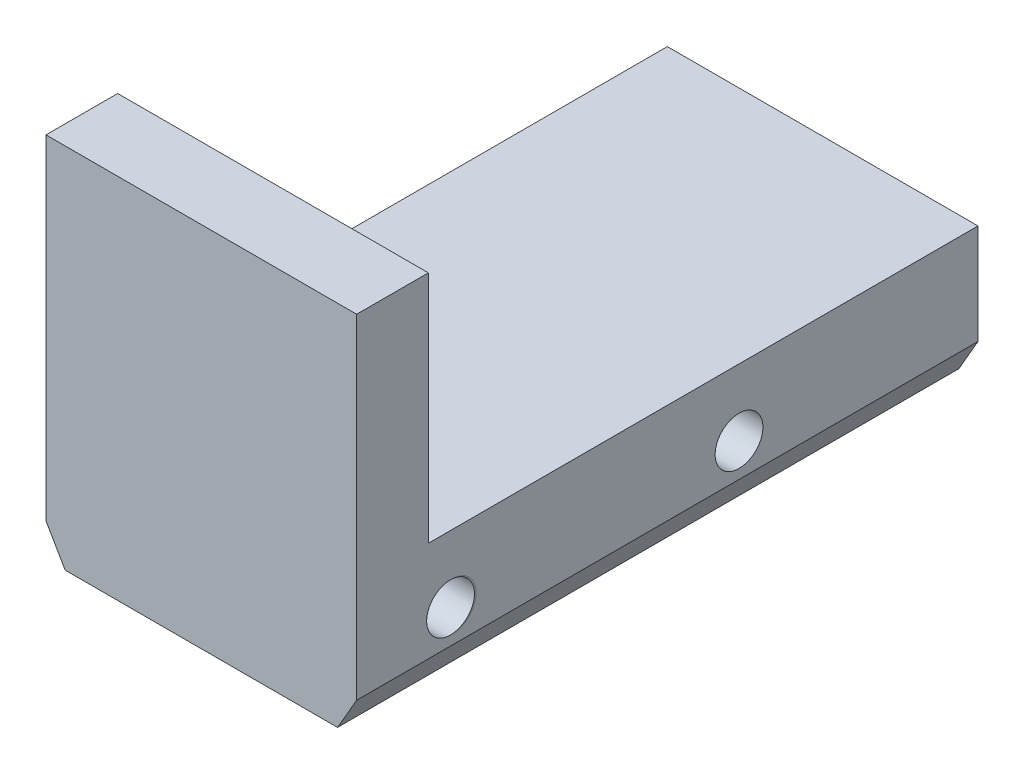
ISO-10303-21;
HEADER;
FILE_DESCRIPTION(('STEP AP214'),'2;1');
FILE_NAME('part.step','',(''),(''),'','','');
FILE_SCHEMA(('AUTOMOTIVE_DESIGN { 1 0 10303 214 1 1 1 1 }'));
ENDSEC;
DATA;
#1=APPLICATION_CONTEXT('core data for automotive mechanical design processes');
#2=APPLICATION_PROTOCOL_DEFINITION('international standard','automotive_design',2000,#1);
#3=PRODUCT_CONTEXT('',#1,'mechanical');
#4=PRODUCT('Part','Part','',(#3));
#5=PRODUCT_RELATED_PRODUCT_CATEGORY('part','',(#4));
#6=PRODUCT_DEFINITION_FORMATION('','',#4);
#7=PRODUCT_DEFINITION_CONTEXT('part definition',#1,'design');
#8=PRODUCT_DEFINITION('design','',#6,#7);
#9=PRODUCT_DEFINITION_SHAPE('','',#8);
#10=(LENGTH_UNIT() NAMED_UNIT(*) SI_UNIT(.MILLI.,.METRE.));
#11=(NAMED_UNIT(*) PLANE_ANGLE_UNIT() SI_UNIT($,.RADIAN.));
#12=(NAMED_UNIT(*) SI_UNIT($,.STERADIAN.) SOLID_ANGLE_UNIT());
#13=UNCERTAINTY_MEASURE_WITH_UNIT(LENGTH_MEASURE(1.E-05),#10,'distance_accuracy_value','');
#14=(GEOMETRIC_REPRESENTATION_CONTEXT(3) GLOBAL_UNCERTAINTY_ASSIGNED_CONTEXT((#13)) GLOBAL_UNIT_ASSIGNED_CONTEXT((#10,
#11,#12)) REPRESENTATION_CONTEXT('',''));
#15=CARTESIAN_POINT('',(0.,0.,0.));
#16=DIRECTION('',(0.,0.,1.));
#17=DIRECTION('',(1.,0.,0.));
#18=AXIS2_PLACEMENT_3D('',#15,#16,#17);
#19=CARTESIAN_POINT('',(0.,5.57372,-26.));
#20=DIRECTION('',(1.,0.,0.));
#21=DIRECTION('',(0.,0.,-1.));
#22=AXIS2_PLACEMENT_3D('',#19,#20,#21);
#23=PLANE('',#22);
#24=CARTESIAN_POINT('',(0.,2.78686,-3.92837));
#25=DIRECTION('',(-1.,0.,0.));
#26=DIRECTION('',(0.,0.,1.));
#27=AXIS2_PLACEMENT_3D('',#24,#25,#26);
#28=CIRCLE('',#27,1.);
#29=CARTESIAN_POINT('',(0.,2.78686,-2.92837));
#30=VERTEX_POINT('',#29);
#31=EDGE_CURVE('E116',#30,#30,#28,.T.);
#32=ORIENTED_EDGE('',*,*,#31,.F.);
#33=EDGE_LOOP('',(#32));
#34=FACE_BOUND('',#33,.T.);
#35=CARTESIAN_POINT('',(0.,2.78686,-16.));
#36=DIRECTION('',(-1.,0.,0.));
#37=DIRECTION('',(0.,0.,1.));
#38=AXIS2_PLACEMENT_3D('',#35,#36,#37);
#39=CIRCLE('',#38,1.);
#40=CARTESIAN_POINT('',(0.,2.78686,-15.));
#41=VERTEX_POINT('',#40);
#42=EDGE_CURVE('E128',#41,#41,#39,.T.);
#43=ORIENTED_EDGE('',*,*,#42,.F.);
#44=EDGE_LOOP('',(#43));
#45=FACE_BOUND('',#44,.T.);
#46=DIRECTION('',(0.,-1.,0.));
#47=VECTOR('',#46,1.);
#48=CARTESIAN_POINT('',(0.,5.57372,-26.));
#49=LINE('',#48,#47);
#50=CARTESIAN_POINT('',(0.,5.57372,-26.));
#51=VERTEX_POINT('',#50);
#52=CARTESIAN_POINT('',(0.,1.38564064605509,-26.));
#53=VERTEX_POINT('',#52);
#54=EDGE_CURVE('E215',#51,#53,#49,.T.);
#55=ORIENTED_EDGE('',*,*,#54,.T.);
#56=DIRECTION('',(0.,0.,1.));
#57=VECTOR('',#56,1.);
#58=CARTESIAN_POINT('',(0.,1.38564064605509,-26.));
#59=LINE('',#58,#57);
#60=CARTESIAN_POINT('',(0.,1.38564064605509,0.));
#61=VERTEX_POINT('',#60);
#62=EDGE_CURVE('E11',#53,#61,#59,.T.);
#63=ORIENTED_EDGE('',*,*,#62,.T.);
#64=DIRECTION('',(0.,-1.,0.));
#65=VECTOR('',#64,1.);
#66=CARTESIAN_POINT('',(0.,5.57372,0.));
#67=LINE('',#66,#65);
#68=CARTESIAN_POINT('',(0.,15.37372,0.));
#69=VERTEX_POINT('',#68);
#70=EDGE_CURVE('E173',#69,#61,#67,.T.);
#71=ORIENTED_EDGE('',*,*,#70,.F.);
#72=DIRECTION('',(0.,0.,1.));
#73=VECTOR('',#72,1.);
#74=CARTESIAN_POINT('',(0.,15.37372,0.));
#75=LINE('',#74,#73);
#76=CARTESIAN_POINT('',(0.,15.37372,-3.));
#77=VERTEX_POINT('',#76);
#78=EDGE_CURVE('E143',#77,#69,#75,.T.);
#79=ORIENTED_EDGE('',*,*,#78,.F.);
#80=DIRECTION('',(0.,-1.,0.));
#81=VECTOR('',#80,1.);
#82=CARTESIAN_POINT('',(0.,15.37372,-3.));
#83=LINE('',#82,#81);
#84=CARTESIAN_POINT('',(0.,5.57372,-3.));
#85=VERTEX_POINT('',#84);
#86=EDGE_CURVE('E146',#77,#85,#83,.T.);
#87=ORIENTED_EDGE('',*,*,#86,.T.);
#88=DIRECTION('',(0.,0.,1.));
#89=VECTOR('',#88,1.);
#90=CARTESIAN_POINT('',(0.,5.57372,-26.));
#91=LINE('',#90,#89);
#92=EDGE_CURVE('E210',#51,#85,#91,.T.);
#93=ORIENTED_EDGE('',*,*,#92,.F.);
#94=EDGE_LOOP('',(#55,#63,#71,#79,#87,#93));
#95=FACE_BOUND('',#94,.T.);
#96=ADVANCED_FACE('F33',(#34,#45,#95),#23,.F.);
#97=CARTESIAN_POINT('',(0.,5.57372,0.));
#98=DIRECTION('',(0.,0.,-1.));
#99=DIRECTION('',(-1.,0.,0.));
#100=AXIS2_PLACEMENT_3D('',#97,#98,#99);
#101=PLANE('',#100);
#102=DIRECTION('',(1.,0.,0.));
#103=VECTOR('',#102,1.);
#104=CARTESIAN_POINT('',(0.,0.,0.));
#105=LINE('',#104,#103);
#106=CARTESIAN_POINT('',(0.799999999999998,0.,0.));
#107=VERTEX_POINT('',#106);
#108=CARTESIAN_POINT('',(12.2,0.,0.));
#109=VERTEX_POINT('',#108);
#110=EDGE_CURVE('E164',#107,#109,#105,.T.);
#111=ORIENTED_EDGE('',*,*,#110,.T.);
#112=DIRECTION('',(-0.500000000000002,-0.866025403784438,0.));
#113=VECTOR('',#112,1.);
#114=CARTESIAN_POINT('',(13.,1.3856406460551,0.));
#115=LINE('',#114,#113);
#116=CARTESIAN_POINT('',(13.,1.3856406460551,0.));
#117=VERTEX_POINT('',#116);
#118=EDGE_CURVE('E41',#109,#117,#115,.F.);
#119=ORIENTED_EDGE('',*,*,#118,.T.);
#120=DIRECTION('',(0.,-1.,0.));
#121=VECTOR('',#120,1.);
#122=CARTESIAN_POINT('',(13.,5.57372,0.));
#123=LINE('',#122,#121);
#124=CARTESIAN_POINT('',(13.,15.37372,0.));
#125=VERTEX_POINT('',#124);
#126=EDGE_CURVE('E187',#125,#117,#123,.T.);
#127=ORIENTED_EDGE('',*,*,#126,.F.);
#128=DIRECTION('',(1.,0.,0.));
#129=VECTOR('',#128,1.);
#130=CARTESIAN_POINT('',(13.,15.37372,0.));
#131=LINE('',#130,#129);
#132=EDGE_CURVE('E135',#69,#125,#131,.T.);
#133=ORIENTED_EDGE('',*,*,#132,.F.);
#134=ORIENTED_EDGE('',*,*,#70,.T.);
#135=DIRECTION('',(-0.500000000000002,0.866025403784437,0.));
#136=VECTOR('',#135,1.);
#137=CARTESIAN_POINT('',(0.,1.38564064605509,0.));
#138=LINE('',#137,#136);
#139=EDGE_CURVE('E56',#61,#107,#138,.F.);
#140=ORIENTED_EDGE('',*,*,#139,.T.);
#141=EDGE_LOOP('',(#111,#119,#127,#133,#134,#140));
#142=FACE_BOUND('',#141,.T.);
#143=ADVANCED_FACE('F185',(#142),#101,.F.);
#144=CARTESIAN_POINT('',(13.,5.57372,0.));
#145=DIRECTION('',(-1.,0.,0.));
#146=DIRECTION('',(0.,0.,1.));
#147=AXIS2_PLACEMENT_3D('',#144,#145,#146);
#148=PLANE('',#147);
#149=CARTESIAN_POINT('',(13.,2.78686,-4.));
#150=DIRECTION('',(-1.,0.,0.));
#151=DIRECTION('',(0.,0.,1.));
#152=AXIS2_PLACEMENT_3D('',#149,#150,#151);
#153=CIRCLE('',#152,1.);
#154=CARTESIAN_POINT('',(13.,3.78621843708601,-3.964185));
#155=VERTEX_POINT('',#154);
#156=CARTESIAN_POINT('',(13.,1.78750156291399,-3.964185));
#157=VERTEX_POINT('',#156);
#158=EDGE_CURVE('E123',#155,#157,#153,.T.);
#159=ORIENTED_EDGE('',*,*,#158,.T.);
#160=CARTESIAN_POINT('',(13.,2.78686,-3.92837));
#161=DIRECTION('',(-1.,0.,0.));
#162=DIRECTION('',(0.,0.,1.));
#163=AXIS2_PLACEMENT_3D('',#160,#161,#162);
#164=CIRCLE('',#163,1.);
#165=EDGE_CURVE('E124',#157,#155,#164,.T.);
#166=ORIENTED_EDGE('',*,*,#165,.T.);
#167=EDGE_LOOP('',(#159,#166));
#168=FACE_BOUND('',#167,.T.);
#169=CARTESIAN_POINT('',(13.,2.78686,-16.));
#170=DIRECTION('',(-1.,0.,0.));
#171=DIRECTION('',(0.,0.,1.));
#172=AXIS2_PLACEMENT_3D('',#169,#170,#171);
#173=CIRCLE('',#172,1.);
#174=CARTESIAN_POINT('',(13.,2.78686,-15.));
#175=VERTEX_POINT('',#174);
#176=EDGE_CURVE('E134',#175,#175,#173,.T.);
#177=ORIENTED_EDGE('',*,*,#176,.T.);
#178=EDGE_LOOP('',(#177));
#179=FACE_BOUND('',#178,.T.);
#180=ORIENTED_EDGE('',*,*,#126,.T.);
#181=DIRECTION('',(0.,0.,-1.));
#182=VECTOR('',#181,1.);
#183=CARTESIAN_POINT('',(13.,1.3856406460551,0.));
#184=LINE('',#183,#182);
#185=CARTESIAN_POINT('',(13.,1.3856406460551,-26.));
#186=VERTEX_POINT('',#185);
#187=EDGE_CURVE('E169',#117,#186,#184,.T.);
#188=ORIENTED_EDGE('',*,*,#187,.T.);
#189=DIRECTION('',(0.,-1.,0.));
#190=VECTOR('',#189,1.);
#191=CARTESIAN_POINT('',(13.,5.57372,-26.));
#192=LINE('',#191,#190);
#193=CARTESIAN_POINT('',(13.,5.57372,-26.));
#194=VERTEX_POINT('',#193);
#195=EDGE_CURVE('E198',#194,#186,#192,.T.);
#196=ORIENTED_EDGE('',*,*,#195,.F.);
#197=DIRECTION('',(0.,0.,-1.));
#198=VECTOR('',#197,1.);
#199=CARTESIAN_POINT('',(13.,5.57372,0.));
#200=LINE('',#199,#198);
#201=CARTESIAN_POINT('',(13.,5.57372,-3.));
#202=VERTEX_POINT('',#201);
#203=EDGE_CURVE('E155',#202,#194,#200,.T.);
#204=ORIENTED_EDGE('',*,*,#203,.F.);
#205=DIRECTION('',(0.,-1.,0.));
#206=VECTOR('',#205,1.);
#207=CARTESIAN_POINT('',(13.,15.37372,-3.));
#208=LINE('',#207,#206);
#209=CARTESIAN_POINT('',(13.,15.37372,-3.));
#210=VERTEX_POINT('',#209);
#211=EDGE_CURVE('E159',#210,#202,#208,.T.);
#212=ORIENTED_EDGE('',*,*,#211,.F.);
#213=DIRECTION('',(0.,0.,-1.));
#214=VECTOR('',#213,1.);
#215=CARTESIAN_POINT('',(13.,15.37372,-3.));
#216=LINE('',#215,#214);
#217=EDGE_CURVE('E138',#125,#210,#216,.T.);
#218=ORIENTED_EDGE('',*,*,#217,.F.);
#219=EDGE_LOOP('',(#180,#188,#196,#204,#212,#218));
#220=FACE_BOUND('',#219,.T.);
#221=ADVANCED_FACE('F194',(#168,#179,#220),#148,.F.);
#222=CARTESIAN_POINT('',(13.,5.57372,-26.));
#223=DIRECTION('',(0.,0.,1.));
#224=DIRECTION('',(1.,0.,0.));
#225=AXIS2_PLACEMENT_3D('',#222,#223,#224);
#226=PLANE('',#225);
#227=ORIENTED_EDGE('',*,*,#195,.T.);
#228=DIRECTION('',(0.500000000000002,0.866025403784438,0.));
#229=VECTOR('',#228,1.);
#230=CARTESIAN_POINT('',(13.,1.3856406460551,-26.));
#231=LINE('',#230,#229);
#232=CARTESIAN_POINT('',(12.2,0.,-26.));
#233=VERTEX_POINT('',#232);
#234=EDGE_CURVE('E175',#186,#233,#231,.F.);
#235=ORIENTED_EDGE('',*,*,#234,.T.);
#236=DIRECTION('',(-1.,0.,0.));
#237=VECTOR('',#236,1.);
#238=CARTESIAN_POINT('',(13.,0.,-26.));
#239=LINE('',#238,#237);
#240=CARTESIAN_POINT('',(0.799999999999995,0.,-26.));
#241=VERTEX_POINT('',#240);
#242=EDGE_CURVE('E205',#233,#241,#239,.T.);
#243=ORIENTED_EDGE('',*,*,#242,.T.);
#244=DIRECTION('',(0.500000000000002,-0.866025403784437,0.));
#245=VECTOR('',#244,1.);
#246=CARTESIAN_POINT('',(0.,1.38564064605509,-26.));
#247=LINE('',#246,#245);
#248=EDGE_CURVE('E172',#241,#53,#247,.F.);
#249=ORIENTED_EDGE('',*,*,#248,.T.);
#250=ORIENTED_EDGE('',*,*,#54,.F.);
#251=DIRECTION('',(-1.,0.,0.));
#252=VECTOR('',#251,1.);
#253=CARTESIAN_POINT('',(13.,5.57372,-26.));
#254=LINE('',#253,#252);
#255=EDGE_CURVE('E218',#194,#51,#254,.T.);
#256=ORIENTED_EDGE('',*,*,#255,.F.);
#257=EDGE_LOOP('',(#227,#235,#243,#249,#250,#256));
#258=FACE_BOUND('',#257,.T.);
#259=ADVANCED_FACE('F204',(#258),#226,.F.);
#260=CARTESIAN_POINT('',(0.,5.57372,0.));
#261=DIRECTION('',(0.,1.,0.));
#262=DIRECTION('',(0.,0.,1.));
#263=AXIS2_PLACEMENT_3D('',#260,#261,#262);
#264=PLANE('',#263);
#265=DIRECTION('',(-1.,0.,0.));
#266=VECTOR('',#265,1.);
#267=CARTESIAN_POINT('',(0.,5.57372,-3.));
#268=LINE('',#267,#266);
#269=EDGE_CURVE('E139',#202,#85,#268,.T.);
#270=ORIENTED_EDGE('',*,*,#269,.F.);
#271=ORIENTED_EDGE('',*,*,#203,.T.);
#272=ORIENTED_EDGE('',*,*,#255,.T.);
#273=ORIENTED_EDGE('',*,*,#92,.T.);
#274=EDGE_LOOP('',(#270,#271,#272,#273));
#275=FACE_BOUND('',#274,.T.);
#276=ADVANCED_FACE('F232',(#275),#264,.T.);
#277=CARTESIAN_POINT('',(0.,0.,0.));
#278=DIRECTION('',(0.,1.,0.));
#279=DIRECTION('',(0.,0.,1.));
#280=AXIS2_PLACEMENT_3D('',#277,#278,#279);
#281=PLANE('',#280);
#282=ORIENTED_EDGE('',*,*,#242,.F.);
#283=DIRECTION('',(0.,0.,1.));
#284=VECTOR('',#283,1.);
#285=CARTESIAN_POINT('',(12.2,0.,0.));
#286=LINE('',#285,#284);
#287=EDGE_CURVE('E179',#233,#109,#286,.T.);
#288=ORIENTED_EDGE('',*,*,#287,.T.);
#289=ORIENTED_EDGE('',*,*,#110,.F.);
#290=DIRECTION('',(0.,0.,-1.));
#291=VECTOR('',#290,1.);
#292=CARTESIAN_POINT('',(0.799999999999999,0.,0.));
#293=LINE('',#292,#291);
#294=EDGE_CURVE('E177',#107,#241,#293,.T.);
#295=ORIENTED_EDGE('',*,*,#294,.T.);
#296=EDGE_LOOP('',(#282,#288,#289,#295));
#297=FACE_BOUND('',#296,.T.);
#298=ADVANCED_FACE('F209',(#297),#281,.F.);
#299=CARTESIAN_POINT('',(0.,15.37372,-3.));
#300=DIRECTION('',(0.,0.,1.));
#301=DIRECTION('',(1.,0.,0.));
#302=AXIS2_PLACEMENT_3D('',#299,#300,#301);
#303=PLANE('',#302);
#304=ORIENTED_EDGE('',*,*,#269,.T.);
#305=ORIENTED_EDGE('',*,*,#86,.F.);
#306=DIRECTION('',(-1.,0.,0.));
#307=VECTOR('',#306,1.);
#308=CARTESIAN_POINT('',(0.,15.37372,-3.));
#309=LINE('',#308,#307);
#310=EDGE_CURVE('E141',#210,#77,#309,.T.);
#311=ORIENTED_EDGE('',*,*,#310,.F.);
#312=ORIENTED_EDGE('',*,*,#211,.T.);
#313=EDGE_LOOP('',(#304,#305,#311,#312));
#314=FACE_BOUND('',#313,.T.);
#315=ADVANCED_FACE('F228',(#314),#303,.F.);
#316=CARTESIAN_POINT('',(0.,15.37372,0.));
#317=DIRECTION('',(0.,-1.,0.));
#318=DIRECTION('',(0.,0.,-1.));
#319=AXIS2_PLACEMENT_3D('',#316,#317,#318);
#320=PLANE('',#319);
#321=ORIENTED_EDGE('',*,*,#132,.T.);
#322=ORIENTED_EDGE('',*,*,#217,.T.);
#323=ORIENTED_EDGE('',*,*,#310,.T.);
#324=ORIENTED_EDGE('',*,*,#78,.T.);
#325=EDGE_LOOP('',(#321,#322,#323,#324));
#326=FACE_BOUND('',#325,.T.);
#327=ADVANCED_FACE('F224',(#326),#320,.F.);
#328=CARTESIAN_POINT('',(13.00005,2.78686,-16.));
#329=DIRECTION('',(-1.,0.,0.));
#330=DIRECTION('',(0.,0.,1.));
#331=AXIS2_PLACEMENT_3D('',#328,#329,#330);
#332=CYLINDRICAL_SURFACE('',#331,1.);
#333=ORIENTED_EDGE('',*,*,#42,.T.);
#334=EDGE_LOOP('',(#333));
#335=FACE_BOUND('',#334,.T.);
#336=ORIENTED_EDGE('',*,*,#176,.F.);
#337=EDGE_LOOP('',(#336));
#338=FACE_BOUND('',#337,.T.);
#339=ADVANCED_FACE('F240',(#335,#338),#332,.F.);
#340=CARTESIAN_POINT('',(13.,1.3856406460551,0.));
#341=DIRECTION('',(-0.866025403784438,0.500000000000002,0.));
#342=DIRECTION('',(0.,0.,-1.));
#343=AXIS2_PLACEMENT_3D('',#340,#341,#342);
#344=PLANE('',#343);
#345=ORIENTED_EDGE('',*,*,#118,.F.);
#346=ORIENTED_EDGE('',*,*,#287,.F.);
#347=ORIENTED_EDGE('',*,*,#234,.F.);
#348=ORIENTED_EDGE('',*,*,#187,.F.);
#349=EDGE_LOOP('',(#345,#346,#347,#348));
#350=FACE_BOUND('',#349,.T.);
#351=ADVANCED_FACE('F200',(#350),#344,.F.);
#352=CARTESIAN_POINT('',(0.,1.38564064605509,-26.));
#353=DIRECTION('',(0.866025403784438,0.500000000000002,0.));
#354=DIRECTION('',(0.,0.,1.));
#355=AXIS2_PLACEMENT_3D('',#352,#353,#354);
#356=PLANE('',#355);
#357=ORIENTED_EDGE('',*,*,#248,.F.);
#358=ORIENTED_EDGE('',*,*,#294,.F.);
#359=ORIENTED_EDGE('',*,*,#139,.F.);
#360=ORIENTED_EDGE('',*,*,#62,.F.);
#361=EDGE_LOOP('',(#357,#358,#359,#360));
#362=FACE_BOUND('',#361,.T.);
#363=ADVANCED_FACE('F35',(#362),#356,.F.);
#364=CARTESIAN_POINT('',(13.00005,2.78686,-4.));
#365=DIRECTION('',(-1.,0.,0.));
#366=DIRECTION('',(0.,0.,1.));
#367=AXIS2_PLACEMENT_3D('',#364,#365,#366);
#368=CYLINDRICAL_SURFACE('',#367,1.);
#369=DIRECTION('',(-1.,0.,0.));
#370=VECTOR('',#369,1.);
#371=CARTESIAN_POINT('',(6.500025,3.78621843708601,-3.964185));
#372=LINE('',#371,#370);
#373=CARTESIAN_POINT('',(13.00005,3.78621843708601,-3.964185));
#374=VERTEX_POINT('',#373);
#375=EDGE_CURVE('E111',#374,#155,#372,.T.);
#376=ORIENTED_EDGE('',*,*,#375,.F.);
#377=CARTESIAN_POINT('',(13.00005,2.78686,-4.));
#378=DIRECTION('',(-1.,0.,0.));
#379=DIRECTION('',(0.,0.,1.));
#380=AXIS2_PLACEMENT_3D('',#377,#378,#379);
#381=CIRCLE('',#380,1.);
#382=CARTESIAN_POINT('',(13.00005,1.78750156291399,-3.964185));
#383=VERTEX_POINT('',#382);
#384=EDGE_CURVE('E121',#374,#383,#381,.T.);
#385=ORIENTED_EDGE('',*,*,#384,.T.);
#386=DIRECTION('',(-1.,0.,0.));
#387=VECTOR('',#386,1.);
#388=CARTESIAN_POINT('',(6.500025,1.78750156291399,-3.964185));
#389=LINE('',#388,#387);
#390=EDGE_CURVE('E48',#157,#383,#389,.F.);
#391=ORIENTED_EDGE('',*,*,#390,.F.);
#392=ORIENTED_EDGE('',*,*,#158,.F.);
#393=EDGE_LOOP('',(#376,#385,#391,#392));
#394=FACE_BOUND('',#393,.T.);
#395=ADVANCED_FACE('F120',(#394),#368,.T.);
#396=CARTESIAN_POINT('',(13.00005,2.78686,-4.));
#397=DIRECTION('',(-1.,0.,0.));
#398=DIRECTION('',(0.,0.,1.));
#399=AXIS2_PLACEMENT_3D('',#396,#397,#398);
#400=PLANE('',#399);
#401=ORIENTED_EDGE('',*,*,#384,.F.);
#402=CARTESIAN_POINT('',(13.00005,2.78686,-3.92837));
#403=DIRECTION('',(-1.,0.,0.));
#404=DIRECTION('',(0.,0.,1.));
#405=AXIS2_PLACEMENT_3D('',#402,#403,#404);
#406=CIRCLE('',#405,1.);
#407=EDGE_CURVE('E107',#374,#383,#406,.T.);
#408=ORIENTED_EDGE('',*,*,#407,.T.);
#409=EDGE_LOOP('',(#401,#408));
#410=FACE_BOUND('',#409,.T.);
#411=ADVANCED_FACE('F126',(#410),#400,.F.);
#412=CARTESIAN_POINT('',(13.00005,2.78686,-3.92837));
#413=DIRECTION('',(-1.,0.,0.));
#414=DIRECTION('',(0.,0.,1.));
#415=AXIS2_PLACEMENT_3D('',#412,#413,#414);
#416=CYLINDRICAL_SURFACE('',#415,1.);
#417=ORIENTED_EDGE('',*,*,#375,.T.);
#418=ORIENTED_EDGE('',*,*,#165,.F.);
#419=ORIENTED_EDGE('',*,*,#390,.T.);
#420=ORIENTED_EDGE('',*,*,#407,.F.);
#421=EDGE_LOOP('',(#417,#418,#419,#420));
#422=FACE_BOUND('',#421,.T.);
#423=ORIENTED_EDGE('',*,*,#31,.T.);
#424=EDGE_LOOP('',(#423));
#425=FACE_BOUND('',#424,.T.);
#426=ADVANCED_FACE('F109',(#422,#425),#416,.F.);
#427=CLOSED_SHELL('',(#96,#143,#221,#259,#276,#298,#315,#327,#339,#351,#363,#395,#411,#426));
#428=MANIFOLD_SOLID_BREP('B2',#427);
#429=ADVANCED_BREP_SHAPE_REPRESENTATION('',(#18,#428),#14);
#430=SHAPE_DEFINITION_REPRESENTATION(#9,#429);
ENDSEC;
END-ISO-10303-21;
